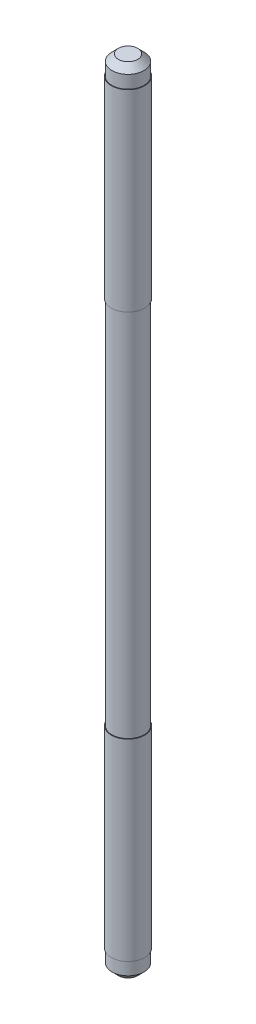
ISO-10303-21;
HEADER;
FILE_DESCRIPTION(('STEP AP214'),'2;1');
FILE_NAME('part.step','',(''),(''),'','','');
FILE_SCHEMA(('AUTOMOTIVE_DESIGN { 1 0 10303 214 1 1 1 1 }'));
ENDSEC;
DATA;
#1=APPLICATION_CONTEXT('core data for automotive mechanical design processes');
#2=APPLICATION_PROTOCOL_DEFINITION('international standard','automotive_design',2000,#1);
#3=PRODUCT_CONTEXT('',#1,'mechanical');
#4=PRODUCT('Part','Part','',(#3));
#5=PRODUCT_RELATED_PRODUCT_CATEGORY('part','',(#4));
#6=PRODUCT_DEFINITION_FORMATION('','',#4);
#7=PRODUCT_DEFINITION_CONTEXT('part definition',#1,'design');
#8=PRODUCT_DEFINITION('design','',#6,#7);
#9=PRODUCT_DEFINITION_SHAPE('','',#8);
#10=(LENGTH_UNIT() NAMED_UNIT(*) SI_UNIT(.MILLI.,.METRE.));
#11=(NAMED_UNIT(*) PLANE_ANGLE_UNIT() SI_UNIT($,.RADIAN.));
#12=(NAMED_UNIT(*) SI_UNIT($,.STERADIAN.) SOLID_ANGLE_UNIT());
#13=UNCERTAINTY_MEASURE_WITH_UNIT(LENGTH_MEASURE(1.E-05),#10,'distance_accuracy_value','');
#14=(GEOMETRIC_REPRESENTATION_CONTEXT(3) GLOBAL_UNCERTAINTY_ASSIGNED_CONTEXT((#13)) GLOBAL_UNIT_ASSIGNED_CONTEXT((#10,
#11,#12)) REPRESENTATION_CONTEXT('',''));
#15=CARTESIAN_POINT('',(0.,0.,0.));
#16=DIRECTION('',(0.,0.,1.));
#17=DIRECTION('',(1.,0.,0.));
#18=AXIS2_PLACEMENT_3D('',#15,#16,#17);
#19=CARTESIAN_POINT('',(-8.395,-30.9,-10.68464163387));
#20=DIRECTION('',(0.,1.,0.));
#21=DIRECTION('',(0.,0.,1.));
#22=AXIS2_PLACEMENT_3D('',#19,#20,#21);
#23=PLANE('',#22);
#24=CARTESIAN_POINT('',(0.,-30.900000000031,0.));
#25=DIRECTION('',(0.,1.,0.));
#26=DIRECTION('',(-1.,0.,0.));
#27=AXIS2_PLACEMENT_3D('',#24,#25,#26);
#28=CIRCLE('',#27,0.749966153136936);
#29=CARTESIAN_POINT('',(-0.749966153136935,-30.900000000031,0.));
#30=VERTEX_POINT('',#29);
#31=EDGE_CURVE('E17',#30,#30,#28,.T.);
#32=ORIENTED_EDGE('',*,*,#31,.F.);
#33=EDGE_LOOP('',(#32));
#34=FACE_BOUND('',#33,.T.);
#35=ADVANCED_FACE('F14',(#34),#23,.F.);
#36=CARTESIAN_POINT('',(-8.395,30.9,11.24016892852));
#37=DIRECTION('',(0.,-1.,0.));
#38=DIRECTION('',(0.,0.,-1.));
#39=AXIS2_PLACEMENT_3D('',#36,#37,#38);
#40=PLANE('',#39);
#41=CARTESIAN_POINT('',(0.,30.900000000031,0.));
#42=DIRECTION('',(0.,-1.,0.));
#43=DIRECTION('',(1.,0.,0.));
#44=AXIS2_PLACEMENT_3D('',#41,#42,#43);
#45=CIRCLE('',#44,0.749966153136936);
#46=CARTESIAN_POINT('',(0.749966153136936,30.900000000031,0.));
#47=VERTEX_POINT('',#46);
#48=EDGE_CURVE('E49',#47,#47,#45,.T.);
#49=ORIENTED_EDGE('',*,*,#48,.F.);
#50=EDGE_LOOP('',(#49));
#51=FACE_BOUND('',#50,.T.);
#52=ADVANCED_FACE('F61',(#51),#40,.F.);
#53=CARTESIAN_POINT('',(0.,-30.3999435862465,0.));
#54=DIRECTION('',(0.,1.,0.));
#55=DIRECTION('',(-1.,0.,0.));
#56=AXIS2_PLACEMENT_3D('',#53,#54,#55);
#57=CONICAL_SURFACE('',#56,1.2499999999136,0.785375598426364);
#58=ORIENTED_EDGE('',*,*,#31,.T.);
#59=EDGE_LOOP('',(#58));
#60=FACE_BOUND('',#59,.T.);
#61=CARTESIAN_POINT('',(0.,-30.3999435862154,0.));
#62=DIRECTION('',(0.,1.,0.));
#63=DIRECTION('',(0.,0.,1.));
#64=AXIS2_PLACEMENT_3D('',#61,#62,#63);
#65=CIRCLE('',#64,1.25);
#66=CARTESIAN_POINT('',(0.,-30.3999435862154,1.25));
#67=VERTEX_POINT('',#66);
#68=EDGE_CURVE('E29',#67,#67,#65,.T.);
#69=ORIENTED_EDGE('',*,*,#68,.F.);
#70=EDGE_LOOP('',(#69));
#71=FACE_BOUND('',#70,.T.);
#72=ADVANCED_FACE('F57',(#60,#71),#57,.T.);
#73=CARTESIAN_POINT('',(0.,30.3999435862465,0.));
#74=DIRECTION('',(0.,-1.,0.));
#75=DIRECTION('',(1.,0.,0.));
#76=AXIS2_PLACEMENT_3D('',#73,#74,#75);
#77=CONICAL_SURFACE('',#76,1.2499999999136,0.785375598426364);
#78=CARTESIAN_POINT('',(0.,30.3999435862154,0.));
#79=DIRECTION('',(0.,1.,0.));
#80=DIRECTION('',(0.,0.,1.));
#81=AXIS2_PLACEMENT_3D('',#78,#79,#80);
#82=CIRCLE('',#81,1.25);
#83=CARTESIAN_POINT('',(0.,30.3999435862154,1.25));
#84=VERTEX_POINT('',#83);
#85=EDGE_CURVE('E48',#84,#84,#82,.F.);
#86=ORIENTED_EDGE('',*,*,#85,.F.);
#87=EDGE_LOOP('',(#86));
#88=FACE_BOUND('',#87,.T.);
#89=ORIENTED_EDGE('',*,*,#48,.T.);
#90=EDGE_LOOP('',(#89));
#91=FACE_BOUND('',#90,.T.);
#92=ADVANCED_FACE('F105',(#88,#91),#77,.T.);
#93=CARTESIAN_POINT('',(0.,-31.1,0.));
#94=DIRECTION('',(0.,1.,0.));
#95=DIRECTION('',(0.,0.,1.));
#96=AXIS2_PLACEMENT_3D('',#93,#94,#95);
#97=CYLINDRICAL_SURFACE('',#96,1.25);
#98=ORIENTED_EDGE('',*,*,#68,.T.);
#99=EDGE_LOOP('',(#98));
#100=FACE_BOUND('',#99,.T.);
#101=CARTESIAN_POINT('',(0.,-29.4,0.));
#102=DIRECTION('',(0.,1.,0.));
#103=DIRECTION('',(0.,0.,1.));
#104=AXIS2_PLACEMENT_3D('',#101,#102,#103);
#105=CIRCLE('',#104,1.25);
#106=CARTESIAN_POINT('',(0.,-29.4,1.25));
#107=VERTEX_POINT('',#106);
#108=EDGE_CURVE('E46',#107,#107,#105,.T.);
#109=ORIENTED_EDGE('',*,*,#108,.F.);
#110=EDGE_LOOP('',(#109));
#111=FACE_BOUND('',#110,.T.);
#112=ADVANCED_FACE('F101',(#100,#111),#97,.T.);
#113=CARTESIAN_POINT('',(0.,-31.1,0.));
#114=DIRECTION('',(0.,1.,0.));
#115=DIRECTION('',(0.,0.,1.));
#116=AXIS2_PLACEMENT_3D('',#113,#114,#115);
#117=CYLINDRICAL_SURFACE('',#116,1.25);
#118=ORIENTED_EDGE('',*,*,#85,.T.);
#119=EDGE_LOOP('',(#118));
#120=FACE_BOUND('',#119,.T.);
#121=CARTESIAN_POINT('',(0.,29.4,0.));
#122=DIRECTION('',(0.,1.,0.));
#123=DIRECTION('',(0.,0.,1.));
#124=AXIS2_PLACEMENT_3D('',#121,#122,#123);
#125=CIRCLE('',#124,1.25);
#126=CARTESIAN_POINT('',(0.,29.4,1.25));
#127=VERTEX_POINT('',#126);
#128=EDGE_CURVE('E43',#127,#127,#125,.T.);
#129=ORIENTED_EDGE('',*,*,#128,.T.);
#130=EDGE_LOOP('',(#129));
#131=FACE_BOUND('',#130,.T.);
#132=ADVANCED_FACE('F97',(#120,#131),#117,.T.);
#133=CARTESIAN_POINT('',(-8.395,-29.4,0.));
#134=DIRECTION('',(0.,-1.,0.));
#135=DIRECTION('',(0.,0.,-1.));
#136=AXIS2_PLACEMENT_3D('',#133,#134,#135);
#137=PLANE('',#136);
#138=CARTESIAN_POINT('',(0.,-29.4,0.));
#139=DIRECTION('',(0.,-1.,0.));
#140=DIRECTION('',(0.,0.,-1.));
#141=AXIS2_PLACEMENT_3D('',#138,#139,#140);
#142=CIRCLE('',#141,1.3);
#143=CARTESIAN_POINT('',(0.,-29.4,-1.3));
#144=VERTEX_POINT('',#143);
#145=EDGE_CURVE('E40',#144,#144,#142,.F.);
#146=ORIENTED_EDGE('',*,*,#145,.F.);
#147=EDGE_LOOP('',(#146));
#148=FACE_BOUND('',#147,.T.);
#149=ORIENTED_EDGE('',*,*,#108,.T.);
#150=EDGE_LOOP('',(#149));
#151=FACE_BOUND('',#150,.T.);
#152=ADVANCED_FACE('F93',(#148,#151),#137,.T.);
#153=CARTESIAN_POINT('',(-8.395,29.4,0.));
#154=DIRECTION('',(0.,-1.,0.));
#155=DIRECTION('',(0.,0.,-1.));
#156=AXIS2_PLACEMENT_3D('',#153,#154,#155);
#157=PLANE('',#156);
#158=CARTESIAN_POINT('',(0.,29.4,0.));
#159=DIRECTION('',(0.,-1.,0.));
#160=DIRECTION('',(0.,0.,-1.));
#161=AXIS2_PLACEMENT_3D('',#158,#159,#160);
#162=CIRCLE('',#161,1.3);
#163=CARTESIAN_POINT('',(0.,29.4,-1.3));
#164=VERTEX_POINT('',#163);
#165=EDGE_CURVE('E37',#164,#164,#162,.T.);
#166=ORIENTED_EDGE('',*,*,#165,.F.);
#167=EDGE_LOOP('',(#166));
#168=FACE_BOUND('',#167,.T.);
#169=ORIENTED_EDGE('',*,*,#128,.F.);
#170=EDGE_LOOP('',(#169));
#171=FACE_BOUND('',#170,.T.);
#172=ADVANCED_FACE('F89',(#168,#171),#157,.F.);
#173=CARTESIAN_POINT('',(0.,-29.4,0.));
#174=DIRECTION('',(0.,-1.,0.));
#175=DIRECTION('',(0.,0.,-1.));
#176=AXIS2_PLACEMENT_3D('',#173,#174,#175);
#177=CYLINDRICAL_SURFACE('',#176,1.3);
#178=ORIENTED_EDGE('',*,*,#145,.T.);
#179=EDGE_LOOP('',(#178));
#180=FACE_BOUND('',#179,.T.);
#181=CARTESIAN_POINT('',(0.,-14.4,0.));
#182=DIRECTION('',(0.,-1.,0.));
#183=DIRECTION('',(0.,0.,-1.));
#184=AXIS2_PLACEMENT_3D('',#181,#182,#183);
#185=CIRCLE('',#184,1.3);
#186=CARTESIAN_POINT('',(0.,-14.4,-1.3));
#187=VERTEX_POINT('',#186);
#188=EDGE_CURVE('E34',#187,#187,#185,.T.);
#189=ORIENTED_EDGE('',*,*,#188,.T.);
#190=EDGE_LOOP('',(#189));
#191=FACE_BOUND('',#190,.T.);
#192=ADVANCED_FACE('F85',(#180,#191),#177,.T.);
#193=CARTESIAN_POINT('',(0.,29.4,0.));
#194=DIRECTION('',(0.,-1.,0.));
#195=DIRECTION('',(0.,0.,-1.));
#196=AXIS2_PLACEMENT_3D('',#193,#194,#195);
#197=CYLINDRICAL_SURFACE('',#196,1.3);
#198=ORIENTED_EDGE('',*,*,#165,.T.);
#199=EDGE_LOOP('',(#198));
#200=FACE_BOUND('',#199,.T.);
#201=CARTESIAN_POINT('',(0.,14.4,0.));
#202=DIRECTION('',(0.,-1.,0.));
#203=DIRECTION('',(0.,0.,-1.));
#204=AXIS2_PLACEMENT_3D('',#201,#202,#203);
#205=CIRCLE('',#204,1.3);
#206=CARTESIAN_POINT('',(0.,14.4,-1.3));
#207=VERTEX_POINT('',#206);
#208=EDGE_CURVE('E26',#207,#207,#205,.T.);
#209=ORIENTED_EDGE('',*,*,#208,.F.);
#210=EDGE_LOOP('',(#209));
#211=FACE_BOUND('',#210,.T.);
#212=ADVANCED_FACE('F81',(#200,#211),#197,.T.);
#213=CARTESIAN_POINT('',(-8.395,-14.4,0.));
#214=DIRECTION('',(0.,-1.,0.));
#215=DIRECTION('',(0.,0.,-1.));
#216=AXIS2_PLACEMENT_3D('',#213,#214,#215);
#217=PLANE('',#216);
#218=ORIENTED_EDGE('',*,*,#188,.F.);
#219=EDGE_LOOP('',(#218));
#220=FACE_BOUND('',#219,.T.);
#221=CARTESIAN_POINT('',(0.,-14.4,0.));
#222=DIRECTION('',(0.,1.,0.));
#223=DIRECTION('',(0.,0.,1.));
#224=AXIS2_PLACEMENT_3D('',#221,#222,#223);
#225=CIRCLE('',#224,1.25);
#226=CARTESIAN_POINT('',(0.,-14.4,1.25));
#227=VERTEX_POINT('',#226);
#228=EDGE_CURVE('E21',#227,#227,#225,.T.);
#229=ORIENTED_EDGE('',*,*,#228,.F.);
#230=EDGE_LOOP('',(#229));
#231=FACE_BOUND('',#230,.T.);
#232=ADVANCED_FACE('F74',(#220,#231),#217,.F.);
#233=CARTESIAN_POINT('',(-8.395,14.4,0.));
#234=DIRECTION('',(0.,-1.,0.));
#235=DIRECTION('',(0.,0.,-1.));
#236=AXIS2_PLACEMENT_3D('',#233,#234,#235);
#237=PLANE('',#236);
#238=ORIENTED_EDGE('',*,*,#208,.T.);
#239=EDGE_LOOP('',(#238));
#240=FACE_BOUND('',#239,.T.);
#241=CARTESIAN_POINT('',(0.,14.4,0.));
#242=DIRECTION('',(0.,1.,0.));
#243=DIRECTION('',(0.,0.,1.));
#244=AXIS2_PLACEMENT_3D('',#241,#242,#243);
#245=CIRCLE('',#244,1.25);
#246=CARTESIAN_POINT('',(0.,14.4,1.25));
#247=VERTEX_POINT('',#246);
#248=EDGE_CURVE('E10',#247,#247,#245,.F.);
#249=ORIENTED_EDGE('',*,*,#248,.F.);
#250=EDGE_LOOP('',(#249));
#251=FACE_BOUND('',#250,.T.);
#252=ADVANCED_FACE('F69',(#240,#251),#237,.T.);
#253=CARTESIAN_POINT('',(0.,-31.1,0.));
#254=DIRECTION('',(0.,1.,0.));
#255=DIRECTION('',(0.,0.,1.));
#256=AXIS2_PLACEMENT_3D('',#253,#254,#255);
#257=CYLINDRICAL_SURFACE('',#256,1.25);
#258=ORIENTED_EDGE('',*,*,#248,.T.);
#259=EDGE_LOOP('',(#258));
#260=FACE_BOUND('',#259,.T.);
#261=ORIENTED_EDGE('',*,*,#228,.T.);
#262=EDGE_LOOP('',(#261));
#263=FACE_BOUND('',#262,.T.);
#264=ADVANCED_FACE('F67',(#260,#263),#257,.T.);
#265=CLOSED_SHELL('',(#35,#52,#72,#92,#112,#132,#152,#172,#192,#212,#232,#252,#264));
#266=MANIFOLD_SOLID_BREP('B1',#265);
#267=ADVANCED_BREP_SHAPE_REPRESENTATION('',(#18,#266),#14);
#268=SHAPE_DEFINITION_REPRESENTATION(#9,#267);
ENDSEC;
END-ISO-10303-21;
